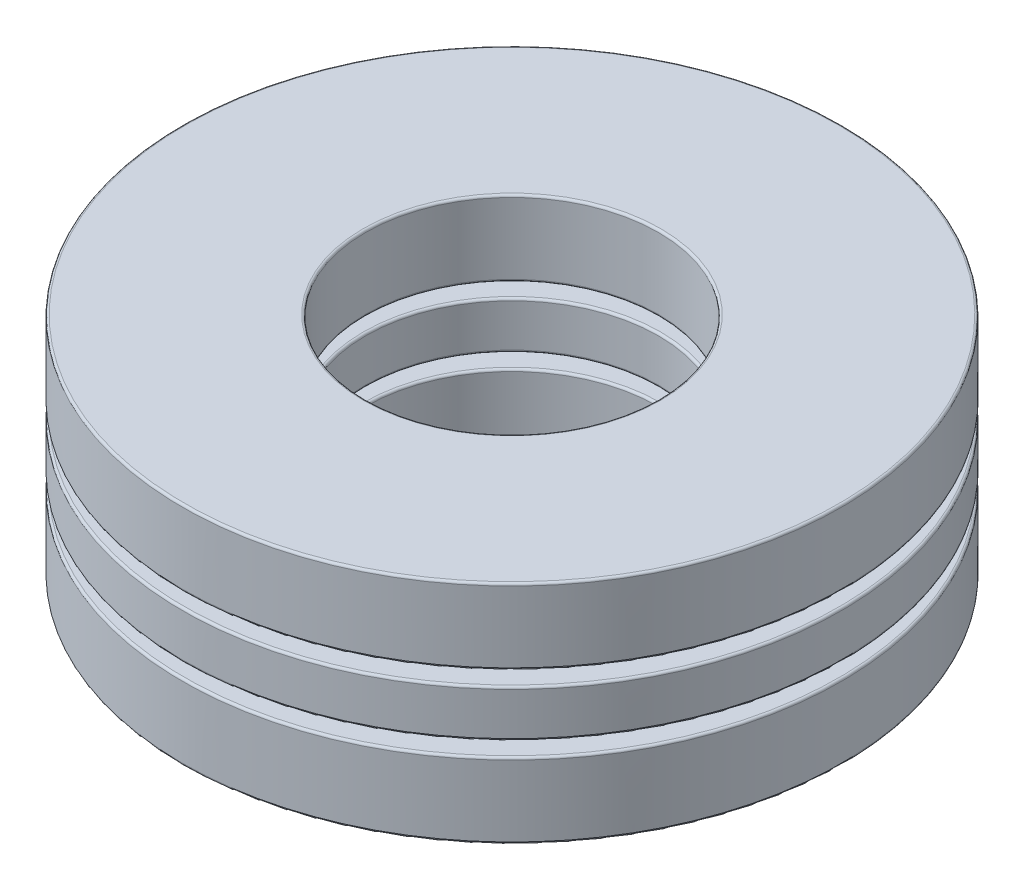
ISO-10303-21;
HEADER;
FILE_DESCRIPTION(('STEP AP214'),'2;1');
FILE_NAME('part.step','',(''),(''),'','','');
FILE_SCHEMA(('AUTOMOTIVE_DESIGN { 1 0 10303 214 1 1 1 1 }'));
ENDSEC;
DATA;
#1=APPLICATION_CONTEXT('core data for automotive mechanical design processes');
#2=APPLICATION_PROTOCOL_DEFINITION('international standard','automotive_design',2000,#1);
#3=PRODUCT_CONTEXT('',#1,'mechanical');
#4=PRODUCT('Part','Part','',(#3));
#5=PRODUCT_RELATED_PRODUCT_CATEGORY('part','',(#4));
#6=PRODUCT_DEFINITION_FORMATION('','',#4);
#7=PRODUCT_DEFINITION_CONTEXT('part definition',#1,'design');
#8=PRODUCT_DEFINITION('design','',#6,#7);
#9=PRODUCT_DEFINITION_SHAPE('','',#8);
#10=(LENGTH_UNIT() NAMED_UNIT(*) SI_UNIT(.MILLI.,.METRE.));
#11=(NAMED_UNIT(*) PLANE_ANGLE_UNIT() SI_UNIT($,.RADIAN.));
#12=(NAMED_UNIT(*) SI_UNIT($,.STERADIAN.) SOLID_ANGLE_UNIT());
#13=UNCERTAINTY_MEASURE_WITH_UNIT(LENGTH_MEASURE(1.E-05),#10,'distance_accuracy_value','');
#14=(GEOMETRIC_REPRESENTATION_CONTEXT(3) GLOBAL_UNCERTAINTY_ASSIGNED_CONTEXT((#13)) GLOBAL_UNIT_ASSIGNED_CONTEXT((#10,
#11,#12)) REPRESENTATION_CONTEXT('',''));
#15=CARTESIAN_POINT('',(0.,0.,0.));
#16=DIRECTION('',(0.,0.,1.));
#17=DIRECTION('',(1.,0.,0.));
#18=AXIS2_PLACEMENT_3D('',#15,#16,#17);
#19=CARTESIAN_POINT('',(0.,-2.4511,0.));
#20=DIRECTION('',(0.,-1.,0.));
#21=DIRECTION('',(0.,0.,-1.));
#22=AXIS2_PLACEMENT_3D('',#19,#20,#21);
#23=CYLINDRICAL_SURFACE('',#22,7.14375);
#24=CARTESIAN_POINT('',(0.,-2.402078,0.));
#25=DIRECTION('',(0.,1.,0.));
#26=DIRECTION('',(0.,0.,1.));
#27=AXIS2_PLACEMENT_3D('',#24,#25,#26);
#28=CIRCLE('',#27,7.14375);
#29=CARTESIAN_POINT('',(0.,-2.402078,7.14375));
#30=VERTEX_POINT('',#29);
#31=EDGE_CURVE('E13',#30,#30,#28,.T.);
#32=ORIENTED_EDGE('',*,*,#31,.T.);
#33=EDGE_LOOP('',(#32));
#34=FACE_BOUND('',#33,.T.);
#35=CARTESIAN_POINT('',(0.,-0.866055333333331,0.));
#36=DIRECTION('',(0.,-1.,0.));
#37=DIRECTION('',(0.,0.,-1.));
#38=AXIS2_PLACEMENT_3D('',#35,#36,#37);
#39=CIRCLE('',#38,7.14375);
#40=CARTESIAN_POINT('',(0.,-0.866055333333331,-7.14375));
#41=VERTEX_POINT('',#40);
#42=EDGE_CURVE('E59',#41,#41,#39,.T.);
#43=ORIENTED_EDGE('',*,*,#42,.T.);
#44=EDGE_LOOP('',(#43));
#45=FACE_BOUND('',#44,.T.);
#46=ADVANCED_FACE('F53',(#34,#45),#23,.T.);
#47=CARTESIAN_POINT('',(0.,-0.817033333333331,7.14375));
#48=DIRECTION('',(0.,-1.,0.));
#49=DIRECTION('',(0.,0.,-1.));
#50=AXIS2_PLACEMENT_3D('',#47,#48,#49);
#51=PLANE('',#50);
#52=CARTESIAN_POINT('',(0.,-0.817033333333331,0.));
#53=DIRECTION('',(0.,-1.,0.));
#54=DIRECTION('',(0.,0.,-1.));
#55=AXIS2_PLACEMENT_3D('',#52,#53,#54);
#56=CIRCLE('',#55,3.224022);
#57=CARTESIAN_POINT('',(0.,-0.817033333333331,-3.224022));
#58=VERTEX_POINT('',#57);
#59=EDGE_CURVE('E63',#58,#58,#56,.T.);
#60=ORIENTED_EDGE('',*,*,#59,.T.);
#61=EDGE_LOOP('',(#60));
#62=FACE_BOUND('',#61,.T.);
#63=CARTESIAN_POINT('',(0.,-0.817033333333331,0.));
#64=DIRECTION('',(0.,-1.,0.));
#65=DIRECTION('',(0.,0.,-1.));
#66=AXIS2_PLACEMENT_3D('',#63,#64,#65);
#67=CIRCLE('',#66,7.094728);
#68=CARTESIAN_POINT('',(0.,-0.817033333333331,-7.094728));
#69=VERTEX_POINT('',#68);
#70=EDGE_CURVE('E67',#69,#69,#67,.F.);
#71=ORIENTED_EDGE('',*,*,#70,.T.);
#72=EDGE_LOOP('',(#71));
#73=FACE_BOUND('',#72,.T.);
#74=ADVANCED_FACE('F95',(#62,#73),#51,.F.);
#75=CARTESIAN_POINT('',(0.,-2.4511,0.));
#76=DIRECTION('',(0.,-1.,0.));
#77=DIRECTION('',(0.,0.,-1.));
#78=AXIS2_PLACEMENT_3D('',#75,#76,#77);
#79=CYLINDRICAL_SURFACE('',#78,3.175);
#80=CARTESIAN_POINT('',(0.,-2.402078,0.));
#81=DIRECTION('',(0.,1.,0.));
#82=DIRECTION('',(0.,0.,1.));
#83=AXIS2_PLACEMENT_3D('',#80,#81,#82);
#84=CIRCLE('',#83,3.175);
#85=CARTESIAN_POINT('',(0.,-2.402078,3.175));
#86=VERTEX_POINT('',#85);
#87=EDGE_CURVE('E78',#86,#86,#84,.F.);
#88=ORIENTED_EDGE('',*,*,#87,.T.);
#89=EDGE_LOOP('',(#88));
#90=FACE_BOUND('',#89,.T.);
#91=CARTESIAN_POINT('',(0.,-0.866055333333331,0.));
#92=DIRECTION('',(0.,-1.,0.));
#93=DIRECTION('',(0.,0.,-1.));
#94=AXIS2_PLACEMENT_3D('',#91,#92,#93);
#95=CIRCLE('',#94,3.175);
#96=CARTESIAN_POINT('',(0.,-0.866055333333331,-3.175));
#97=VERTEX_POINT('',#96);
#98=EDGE_CURVE('E81',#97,#97,#95,.F.);
#99=ORIENTED_EDGE('',*,*,#98,.T.);
#100=EDGE_LOOP('',(#99));
#101=FACE_BOUND('',#100,.T.);
#102=ADVANCED_FACE('F85',(#90,#101),#79,.F.);
#103=CARTESIAN_POINT('',(0.,-2.4511,7.14375));
#104=DIRECTION('',(0.,1.,0.));
#105=DIRECTION('',(0.,0.,1.));
#106=AXIS2_PLACEMENT_3D('',#103,#104,#105);
#107=PLANE('',#106);
#108=CARTESIAN_POINT('',(0.,-2.4511,0.));
#109=DIRECTION('',(0.,1.,0.));
#110=DIRECTION('',(0.,0.,1.));
#111=AXIS2_PLACEMENT_3D('',#108,#109,#110);
#112=CIRCLE('',#111,3.224022);
#113=CARTESIAN_POINT('',(0.,-2.4511,3.224022));
#114=VERTEX_POINT('',#113);
#115=EDGE_CURVE('E72',#114,#114,#112,.T.);
#116=ORIENTED_EDGE('',*,*,#115,.T.);
#117=EDGE_LOOP('',(#116));
#118=FACE_BOUND('',#117,.T.);
#119=CARTESIAN_POINT('',(0.,-2.4511,0.));
#120=DIRECTION('',(0.,1.,0.));
#121=DIRECTION('',(0.,0.,1.));
#122=AXIS2_PLACEMENT_3D('',#119,#120,#121);
#123=CIRCLE('',#122,7.094728);
#124=CARTESIAN_POINT('',(0.,-2.4511,7.094728));
#125=VERTEX_POINT('',#124);
#126=EDGE_CURVE('E75',#125,#125,#123,.F.);
#127=ORIENTED_EDGE('',*,*,#126,.T.);
#128=EDGE_LOOP('',(#127));
#129=FACE_BOUND('',#128,.T.);
#130=ADVANCED_FACE('F122',(#118,#129),#107,.F.);
#131=CARTESIAN_POINT('',(0.,-2.402078,0.));
#132=DIRECTION('',(0.,1.,0.));
#133=DIRECTION('',(0.,0.,1.));
#134=AXIS2_PLACEMENT_3D('',#131,#132,#133);
#135=TOROIDAL_SURFACE('',#134,3.224022,0.049022);
#136=ORIENTED_EDGE('',*,*,#115,.F.);
#137=EDGE_LOOP('',(#136));
#138=FACE_BOUND('',#137,.T.);
#139=ORIENTED_EDGE('',*,*,#87,.F.);
#140=EDGE_LOOP('',(#139));
#141=FACE_BOUND('',#140,.T.);
#142=ADVANCED_FACE('F91',(#138,#141),#135,.T.);
#143=CARTESIAN_POINT('',(0.,-0.866055333333331,0.));
#144=DIRECTION('',(0.,-1.,0.));
#145=DIRECTION('',(0.,0.,-1.));
#146=AXIS2_PLACEMENT_3D('',#143,#144,#145);
#147=TOROIDAL_SURFACE('',#146,3.224022,0.049022);
#148=ORIENTED_EDGE('',*,*,#98,.F.);
#149=EDGE_LOOP('',(#148));
#150=FACE_BOUND('',#149,.T.);
#151=ORIENTED_EDGE('',*,*,#59,.F.);
#152=EDGE_LOOP('',(#151));
#153=FACE_BOUND('',#152,.T.);
#154=ADVANCED_FACE('F87',(#150,#153),#147,.T.);
#155=CARTESIAN_POINT('',(0.,-2.402078,0.));
#156=DIRECTION('',(0.,1.,0.));
#157=DIRECTION('',(0.,0.,1.));
#158=AXIS2_PLACEMENT_3D('',#155,#156,#157);
#159=TOROIDAL_SURFACE('',#158,7.094728,0.049022);
#160=ORIENTED_EDGE('',*,*,#31,.F.);
#161=EDGE_LOOP('',(#160));
#162=FACE_BOUND('',#161,.T.);
#163=ORIENTED_EDGE('',*,*,#126,.F.);
#164=EDGE_LOOP('',(#163));
#165=FACE_BOUND('',#164,.T.);
#166=ADVANCED_FACE('F90',(#162,#165),#159,.T.);
#167=CARTESIAN_POINT('',(0.,-0.866055333333331,0.));
#168=DIRECTION('',(0.,-1.,0.));
#169=DIRECTION('',(0.,0.,-1.));
#170=AXIS2_PLACEMENT_3D('',#167,#168,#169);
#171=TOROIDAL_SURFACE('',#170,7.094728,0.049022);
#172=ORIENTED_EDGE('',*,*,#70,.F.);
#173=EDGE_LOOP('',(#172));
#174=FACE_BOUND('',#173,.T.);
#175=ORIENTED_EDGE('',*,*,#42,.F.);
#176=EDGE_LOOP('',(#175));
#177=FACE_BOUND('',#176,.T.);
#178=ADVANCED_FACE('F100',(#174,#177),#171,.T.);
#179=CLOSED_SHELL('',(#46,#74,#102,#130,#142,#154,#166,#178));
#180=MANIFOLD_SOLID_BREP('B2',#179);
#181=CARTESIAN_POINT('',(0.,-2.4511,0.));
#182=DIRECTION('',(0.,-1.,0.));
#183=DIRECTION('',(0.,0.,-1.));
#184=AXIS2_PLACEMENT_3D('',#181,#182,#183);
#185=CYLINDRICAL_SURFACE('',#184,7.14375);
#186=CARTESIAN_POINT('',(0.,0.866055333333332,0.));
#187=DIRECTION('',(0.,1.,0.));
#188=DIRECTION('',(0.,0.,1.));
#189=AXIS2_PLACEMENT_3D('',#186,#187,#188);
#190=CIRCLE('',#189,7.14375);
#191=CARTESIAN_POINT('',(0.,0.866055333333332,7.14375));
#192=VERTEX_POINT('',#191);
#193=EDGE_CURVE('E52',#192,#192,#190,.T.);
#194=ORIENTED_EDGE('',*,*,#193,.T.);
#195=EDGE_LOOP('',(#194));
#196=FACE_BOUND('',#195,.T.);
#197=CARTESIAN_POINT('',(0.,2.402078,0.));
#198=DIRECTION('',(0.,-1.,0.));
#199=DIRECTION('',(0.,0.,-1.));
#200=AXIS2_PLACEMENT_3D('',#197,#198,#199);
#201=CIRCLE('',#200,7.14375);
#202=CARTESIAN_POINT('',(0.,2.402078,-7.14375));
#203=VERTEX_POINT('',#202);
#204=EDGE_CURVE('E192',#203,#203,#201,.T.);
#205=ORIENTED_EDGE('',*,*,#204,.T.);
#206=EDGE_LOOP('',(#205));
#207=FACE_BOUND('',#206,.T.);
#208=ADVANCED_FACE('F186',(#196,#207),#185,.T.);
#209=CARTESIAN_POINT('',(0.,2.4511,7.14375));
#210=DIRECTION('',(0.,-1.,0.));
#211=DIRECTION('',(0.,0.,-1.));
#212=AXIS2_PLACEMENT_3D('',#209,#210,#211);
#213=PLANE('',#212);
#214=CARTESIAN_POINT('',(0.,2.4511,0.));
#215=DIRECTION('',(0.,-1.,0.));
#216=DIRECTION('',(0.,0.,-1.));
#217=AXIS2_PLACEMENT_3D('',#214,#215,#216);
#218=CIRCLE('',#217,3.224022);
#219=CARTESIAN_POINT('',(0.,2.4511,-3.224022));
#220=VERTEX_POINT('',#219);
#221=EDGE_CURVE('E196',#220,#220,#218,.T.);
#222=ORIENTED_EDGE('',*,*,#221,.T.);
#223=EDGE_LOOP('',(#222));
#224=FACE_BOUND('',#223,.T.);
#225=CARTESIAN_POINT('',(0.,2.4511,0.));
#226=DIRECTION('',(0.,-1.,0.));
#227=DIRECTION('',(0.,0.,-1.));
#228=AXIS2_PLACEMENT_3D('',#225,#226,#227);
#229=CIRCLE('',#228,7.094728);
#230=CARTESIAN_POINT('',(0.,2.4511,-7.094728));
#231=VERTEX_POINT('',#230);
#232=EDGE_CURVE('E200',#231,#231,#229,.F.);
#233=ORIENTED_EDGE('',*,*,#232,.T.);
#234=EDGE_LOOP('',(#233));
#235=FACE_BOUND('',#234,.T.);
#236=ADVANCED_FACE('F228',(#224,#235),#213,.F.);
#237=CARTESIAN_POINT('',(0.,-2.4511,0.));
#238=DIRECTION('',(0.,-1.,0.));
#239=DIRECTION('',(0.,0.,-1.));
#240=AXIS2_PLACEMENT_3D('',#237,#238,#239);
#241=CYLINDRICAL_SURFACE('',#240,3.175);
#242=CARTESIAN_POINT('',(0.,0.866055333333332,0.));
#243=DIRECTION('',(0.,1.,0.));
#244=DIRECTION('',(0.,0.,1.));
#245=AXIS2_PLACEMENT_3D('',#242,#243,#244);
#246=CIRCLE('',#245,3.175);
#247=CARTESIAN_POINT('',(0.,0.866055333333332,3.175));
#248=VERTEX_POINT('',#247);
#249=EDGE_CURVE('E211',#248,#248,#246,.F.);
#250=ORIENTED_EDGE('',*,*,#249,.T.);
#251=EDGE_LOOP('',(#250));
#252=FACE_BOUND('',#251,.T.);
#253=CARTESIAN_POINT('',(0.,2.402078,0.));
#254=DIRECTION('',(0.,-1.,0.));
#255=DIRECTION('',(0.,0.,-1.));
#256=AXIS2_PLACEMENT_3D('',#253,#254,#255);
#257=CIRCLE('',#256,3.175);
#258=CARTESIAN_POINT('',(0.,2.402078,-3.175));
#259=VERTEX_POINT('',#258);
#260=EDGE_CURVE('E214',#259,#259,#257,.F.);
#261=ORIENTED_EDGE('',*,*,#260,.T.);
#262=EDGE_LOOP('',(#261));
#263=FACE_BOUND('',#262,.T.);
#264=ADVANCED_FACE('F218',(#252,#263),#241,.F.);
#265=CARTESIAN_POINT('',(0.,0.817033333333333,7.14375));
#266=DIRECTION('',(0.,1.,0.));
#267=DIRECTION('',(0.,0.,1.));
#268=AXIS2_PLACEMENT_3D('',#265,#266,#267);
#269=PLANE('',#268);
#270=CARTESIAN_POINT('',(0.,0.817033333333333,0.));
#271=DIRECTION('',(0.,1.,0.));
#272=DIRECTION('',(0.,0.,1.));
#273=AXIS2_PLACEMENT_3D('',#270,#271,#272);
#274=CIRCLE('',#273,3.224022);
#275=CARTESIAN_POINT('',(0.,0.817033333333333,3.224022));
#276=VERTEX_POINT('',#275);
#277=EDGE_CURVE('E205',#276,#276,#274,.T.);
#278=ORIENTED_EDGE('',*,*,#277,.T.);
#279=EDGE_LOOP('',(#278));
#280=FACE_BOUND('',#279,.T.);
#281=CARTESIAN_POINT('',(0.,0.817033333333333,0.));
#282=DIRECTION('',(0.,1.,0.));
#283=DIRECTION('',(0.,0.,1.));
#284=AXIS2_PLACEMENT_3D('',#281,#282,#283);
#285=CIRCLE('',#284,7.094728);
#286=CARTESIAN_POINT('',(0.,0.817033333333333,7.094728));
#287=VERTEX_POINT('',#286);
#288=EDGE_CURVE('E208',#287,#287,#285,.F.);
#289=ORIENTED_EDGE('',*,*,#288,.T.);
#290=EDGE_LOOP('',(#289));
#291=FACE_BOUND('',#290,.T.);
#292=ADVANCED_FACE('F255',(#280,#291),#269,.F.);
#293=CARTESIAN_POINT('',(0.,0.866055333333332,0.));
#294=DIRECTION('',(0.,1.,0.));
#295=DIRECTION('',(0.,0.,1.));
#296=AXIS2_PLACEMENT_3D('',#293,#294,#295);
#297=TOROIDAL_SURFACE('',#296,3.224022,0.049022);
#298=ORIENTED_EDGE('',*,*,#277,.F.);
#299=EDGE_LOOP('',(#298));
#300=FACE_BOUND('',#299,.T.);
#301=ORIENTED_EDGE('',*,*,#249,.F.);
#302=EDGE_LOOP('',(#301));
#303=FACE_BOUND('',#302,.T.);
#304=ADVANCED_FACE('F224',(#300,#303),#297,.T.);
#305=CARTESIAN_POINT('',(0.,2.402078,0.));
#306=DIRECTION('',(0.,-1.,0.));
#307=DIRECTION('',(0.,0.,-1.));
#308=AXIS2_PLACEMENT_3D('',#305,#306,#307);
#309=TOROIDAL_SURFACE('',#308,3.224022,0.049022);
#310=ORIENTED_EDGE('',*,*,#260,.F.);
#311=EDGE_LOOP('',(#310));
#312=FACE_BOUND('',#311,.T.);
#313=ORIENTED_EDGE('',*,*,#221,.F.);
#314=EDGE_LOOP('',(#313));
#315=FACE_BOUND('',#314,.T.);
#316=ADVANCED_FACE('F220',(#312,#315),#309,.T.);
#317=CARTESIAN_POINT('',(0.,0.866055333333332,0.));
#318=DIRECTION('',(0.,1.,0.));
#319=DIRECTION('',(0.,0.,1.));
#320=AXIS2_PLACEMENT_3D('',#317,#318,#319);
#321=TOROIDAL_SURFACE('',#320,7.094728,0.049022);
#322=ORIENTED_EDGE('',*,*,#193,.F.);
#323=EDGE_LOOP('',(#322));
#324=FACE_BOUND('',#323,.T.);
#325=ORIENTED_EDGE('',*,*,#288,.F.);
#326=EDGE_LOOP('',(#325));
#327=FACE_BOUND('',#326,.T.);
#328=ADVANCED_FACE('F223',(#324,#327),#321,.T.);
#329=CARTESIAN_POINT('',(0.,2.402078,0.));
#330=DIRECTION('',(0.,-1.,0.));
#331=DIRECTION('',(0.,0.,-1.));
#332=AXIS2_PLACEMENT_3D('',#329,#330,#331);
#333=TOROIDAL_SURFACE('',#332,7.094728,0.049022);
#334=ORIENTED_EDGE('',*,*,#232,.F.);
#335=EDGE_LOOP('',(#334));
#336=FACE_BOUND('',#335,.T.);
#337=ORIENTED_EDGE('',*,*,#204,.F.);
#338=EDGE_LOOP('',(#337));
#339=FACE_BOUND('',#338,.T.);
#340=ADVANCED_FACE('F233',(#336,#339),#333,.T.);
#341=CLOSED_SHELL('',(#208,#236,#264,#292,#304,#316,#328,#340));
#342=MANIFOLD_SOLID_BREP('B8',#341);
#343=CARTESIAN_POINT('',(-4.03376180485845,0.,3.21681769646495));
#344=DIRECTION('',(0.,1.,0.));
#345=DIRECTION('',(0.781831482468022,0.,-0.623489801858743));
#346=AXIS2_PLACEMENT_3D('',#343,#344,#345);
#347=SPHERICAL_SURFACE('',#346,0.817033333333333);
#348=CARTESIAN_POINT('',(-4.03376180485845,0.817033333333333,3.21681769646495));
#349=VERTEX_POINT('',#348);
#350=VERTEX_LOOP('',#349);
#351=FACE_BOUND('',#350,.T.);
#352=ADVANCED_FACE('F314',(#351),#347,.T.);
#353=CLOSED_SHELL('',(#352));
#354=MANIFOLD_SOLID_BREP('B47',#353);
#355=CARTESIAN_POINT('',(-5.03001869691311,0.,-1.14806894363081));
#356=DIRECTION('',(0.,1.,0.));
#357=DIRECTION('',(0.974927912181826,0.,0.222520933956305));
#358=AXIS2_PLACEMENT_3D('',#355,#356,#357);
#359=SPHERICAL_SURFACE('',#358,0.817033333333333);
#360=CARTESIAN_POINT('',(-5.03001869691311,0.817033333333333,-1.14806894363081));
#361=VERTEX_POINT('',#360);
#362=VERTEX_LOOP('',#361);
#363=FACE_BOUND('',#362,.T.);
#364=ADVANCED_FACE('F335',(#363),#359,.T.);
#365=CLOSED_SHELL('',(#364));
#366=MANIFOLD_SOLID_BREP('B182',#365);
#367=CARTESIAN_POINT('',(-2.23856891650969,0.,-4.64843625283403));
#368=DIRECTION('',(0.,1.,0.));
#369=DIRECTION('',(0.433883739117565,0.,0.900968867902416));
#370=AXIS2_PLACEMENT_3D('',#367,#368,#369);
#371=SPHERICAL_SURFACE('',#370,0.817033333333333);
#372=CARTESIAN_POINT('',(-2.23856891650969,0.817033333333333,-4.64843625283403));
#373=VERTEX_POINT('',#372);
#374=VERTEX_LOOP('',#373);
#375=FACE_BOUND('',#374,.T.);
#376=ADVANCED_FACE('F354',(#375),#371,.T.);
#377=CLOSED_SHELL('',(#376));
#378=MANIFOLD_SOLID_BREP('B310',#377);
#379=CARTESIAN_POINT('',(2.23856891650962,0.,-4.64843625283406));
#380=DIRECTION('',(0.,1.,0.));
#381=DIRECTION('',(-0.433883739117553,0.,0.900968867902422));
#382=AXIS2_PLACEMENT_3D('',#379,#380,#381);
#383=SPHERICAL_SURFACE('',#382,0.817033333333333);
#384=CARTESIAN_POINT('',(2.23856891650962,0.817033333333333,-4.64843625283406));
#385=VERTEX_POINT('',#384);
#386=VERTEX_LOOP('',#385);
#387=FACE_BOUND('',#386,.T.);
#388=ADVANCED_FACE('F376',(#387),#383,.T.);
#389=CLOSED_SHELL('',(#388));
#390=MANIFOLD_SOLID_BREP('B331',#389);
#391=CARTESIAN_POINT('',(5.03001869691309,0.,-1.14806894363088));
#392=DIRECTION('',(0.,1.,0.));
#393=DIRECTION('',(-0.974927912181823,0.,0.222520933956318));
#394=AXIS2_PLACEMENT_3D('',#391,#392,#393);
#395=SPHERICAL_SURFACE('',#394,0.817033333333333);
#396=CARTESIAN_POINT('',(5.03001869691309,0.817033333333333,-1.14806894363088));
#397=VERTEX_POINT('',#396);
#398=VERTEX_LOOP('',#397);
#399=FACE_BOUND('',#398,.T.);
#400=ADVANCED_FACE('F397',(#399),#395,.T.);
#401=CLOSED_SHELL('',(#400));
#402=MANIFOLD_SOLID_BREP('B350',#401);
#403=CARTESIAN_POINT('',(4.0337618048585,0.,3.2168176964649));
#404=DIRECTION('',(0.,1.,0.));
#405=DIRECTION('',(-0.781831482468031,0.,-0.623489801858732));
#406=AXIS2_PLACEMENT_3D('',#403,#404,#405);
#407=SPHERICAL_SURFACE('',#406,0.817033333333333);
#408=CARTESIAN_POINT('',(4.0337618048585,0.817033333333333,3.2168176964649));
#409=VERTEX_POINT('',#408);
#410=VERTEX_LOOP('',#409);
#411=FACE_BOUND('',#410,.T.);
#412=ADVANCED_FACE('F415',(#411),#407,.T.);
#413=CLOSED_SHELL('',(#412));
#414=MANIFOLD_SOLID_BREP('B372',#413);
#415=CARTESIAN_POINT('',(0.,0.,5.159375));
#416=DIRECTION('',(0.,1.,0.));
#417=DIRECTION('',(0.,0.,-1.));
#418=AXIS2_PLACEMENT_3D('',#415,#416,#417);
#419=SPHERICAL_SURFACE('',#418,0.817033333333333);
#420=CARTESIAN_POINT('',(0.,0.817033333333333,5.159375));
#421=VERTEX_POINT('',#420);
#422=VERTEX_LOOP('',#421);
#423=FACE_BOUND('',#422,.T.);
#424=ADVANCED_FACE('F435',(#423),#419,.T.);
#425=CLOSED_SHELL('',(#424));
#426=MANIFOLD_SOLID_BREP('B393',#425);
#427=CARTESIAN_POINT('',(0.,-2.4511,0.));
#428=DIRECTION('',(0.,-1.,0.));
#429=DIRECTION('',(0.,0.,-1.));
#430=AXIS2_PLACEMENT_3D('',#427,#428,#429);
#431=CYLINDRICAL_SURFACE('',#430,7.14375);
#432=CARTESIAN_POINT('',(0.,-0.461623833333338,0.));
#433=DIRECTION('',(0.,1.,0.));
#434=DIRECTION('',(0.,0.,1.));
#435=AXIS2_PLACEMENT_3D('',#432,#433,#434);
#436=CIRCLE('',#435,7.14375);
#437=CARTESIAN_POINT('',(0.,-0.461623833333338,7.14375));
#438=VERTEX_POINT('',#437);
#439=EDGE_CURVE('E434',#438,#438,#436,.T.);
#440=ORIENTED_EDGE('',*,*,#439,.T.);
#441=EDGE_LOOP('',(#440));
#442=FACE_BOUND('',#441,.T.);
#443=CARTESIAN_POINT('',(0.,0.461623833333328,0.));
#444=DIRECTION('',(0.,-1.,0.));
#445=DIRECTION('',(0.,0.,-1.));
#446=AXIS2_PLACEMENT_3D('',#443,#444,#445);
#447=CIRCLE('',#446,7.14375);
#448=CARTESIAN_POINT('',(0.,0.461623833333328,-7.14375));
#449=VERTEX_POINT('',#448);
#450=EDGE_CURVE('E457',#449,#449,#447,.T.);
#451=ORIENTED_EDGE('',*,*,#450,.T.);
#452=EDGE_LOOP('',(#451));
#453=FACE_BOUND('',#452,.T.);
#454=ADVANCED_FACE('F451',(#442,#453),#431,.T.);
#455=CARTESIAN_POINT('',(0.,-0.510645833333338,7.14375));
#456=DIRECTION('',(0.,1.,0.));
#457=DIRECTION('',(0.,0.,1.));
#458=AXIS2_PLACEMENT_3D('',#455,#456,#457);
#459=PLANE('',#458);
#460=CARTESIAN_POINT('',(0.,-0.510645833333338,0.));
#461=DIRECTION('',(0.,1.,0.));
#462=DIRECTION('',(0.,0.,1.));
#463=AXIS2_PLACEMENT_3D('',#460,#461,#462);
#464=CIRCLE('',#463,3.224022);
#465=CARTESIAN_POINT('',(0.,-0.510645833333338,3.224022));
#466=VERTEX_POINT('',#465);
#467=EDGE_CURVE('E470',#466,#466,#464,.T.);
#468=ORIENTED_EDGE('',*,*,#467,.T.);
#469=EDGE_LOOP('',(#468));
#470=FACE_BOUND('',#469,.T.);
#471=CARTESIAN_POINT('',(0.,-0.510645833333338,0.));
#472=DIRECTION('',(0.,1.,0.));
#473=DIRECTION('',(0.,0.,1.));
#474=AXIS2_PLACEMENT_3D('',#471,#472,#473);
#475=CIRCLE('',#474,7.094728);
#476=CARTESIAN_POINT('',(0.,-0.510645833333338,7.094728));
#477=VERTEX_POINT('',#476);
#478=EDGE_CURVE('E473',#477,#477,#475,.F.);
#479=ORIENTED_EDGE('',*,*,#478,.T.);
#480=EDGE_LOOP('',(#479));
#481=FACE_BOUND('',#480,.T.);
#482=CARTESIAN_POINT('',(-4.03376180485845,-0.510645833333338,3.21681769646495));
#483=DIRECTION('',(0.,1.,0.));
#484=DIRECTION('',(-0.781831482468022,0.,0.623489801858743));
#485=AXIS2_PLACEMENT_3D('',#482,#483,#484);
#486=CIRCLE('',#485,0.637796441411426);
#487=CARTESIAN_POINT('',(-4.53241114215998,-0.510645833333338,3.61447727334677));
#488=VERTEX_POINT('',#487);
#489=EDGE_CURVE('E518',#488,#488,#486,.T.);
#490=ORIENTED_EDGE('',*,*,#489,.T.);
#491=EDGE_LOOP('',(#490));
#492=FACE_BOUND('',#491,.T.);
#493=CARTESIAN_POINT('',(-5.03001869691311,-0.510645833333338,-1.14806894363081));
#494=DIRECTION('',(0.,1.,0.));
#495=DIRECTION('',(-0.974927912181826,0.,-0.222520933956305));
#496=AXIS2_PLACEMENT_3D('',#493,#494,#495);
#497=CIRCLE('',#496,0.637796441411426);
#498=CARTESIAN_POINT('',(-5.65182424993535,-0.510645833333338,-1.28999200344769));
#499=VERTEX_POINT('',#498);
#500=EDGE_CURVE('E512',#499,#499,#497,.T.);
#501=ORIENTED_EDGE('',*,*,#500,.T.);
#502=EDGE_LOOP('',(#501));
#503=FACE_BOUND('',#502,.T.);
#504=CARTESIAN_POINT('',(-2.23856891650969,-0.510645833333338,-4.64843625283403));
#505=DIRECTION('',(0.,1.,0.));
#506=DIRECTION('',(-0.433883739117565,0.,-0.900968867902416));
#507=AXIS2_PLACEMENT_3D('',#504,#505,#506);
#508=CIRCLE('',#507,0.637796441411426);
#509=CARTESIAN_POINT('',(-2.51529842130515,-0.510645833333338,-5.22307099060467));
#510=VERTEX_POINT('',#509);
#511=EDGE_CURVE('E506',#510,#510,#508,.T.);
#512=ORIENTED_EDGE('',*,*,#511,.T.);
#513=EDGE_LOOP('',(#512));
#514=FACE_BOUND('',#513,.T.);
#515=CARTESIAN_POINT('',(2.23856891650962,-0.510645833333338,-4.64843625283406));
#516=DIRECTION('',(0.,1.,0.));
#517=DIRECTION('',(0.433883739117553,0.,-0.900968867902422));
#518=AXIS2_PLACEMENT_3D('',#515,#516,#517);
#519=CIRCLE('',#518,0.637796441411426);
#520=CARTESIAN_POINT('',(2.51529842130508,-0.510645833333338,-5.2230709906047));
#521=VERTEX_POINT('',#520);
#522=EDGE_CURVE('E500',#521,#521,#519,.T.);
#523=ORIENTED_EDGE('',*,*,#522,.T.);
#524=EDGE_LOOP('',(#523));
#525=FACE_BOUND('',#524,.T.);
#526=CARTESIAN_POINT('',(5.03001869691309,-0.510645833333338,-1.14806894363088));
#527=DIRECTION('',(0.,1.,0.));
#528=DIRECTION('',(0.974927912181823,0.,-0.222520933956318));
#529=AXIS2_PLACEMENT_3D('',#526,#527,#528);
#530=CIRCLE('',#529,0.637796441411426);
#531=CARTESIAN_POINT('',(5.65182424993533,-0.510645833333338,-1.28999200344777));
#532=VERTEX_POINT('',#531);
#533=EDGE_CURVE('E494',#532,#532,#530,.T.);
#534=ORIENTED_EDGE('',*,*,#533,.T.);
#535=EDGE_LOOP('',(#534));
#536=FACE_BOUND('',#535,.T.);
#537=CARTESIAN_POINT('',(4.0337618048585,-0.510645833333338,3.2168176964649));
#538=DIRECTION('',(0.,1.,0.));
#539=DIRECTION('',(0.781831482468031,0.,0.623489801858732));
#540=AXIS2_PLACEMENT_3D('',#537,#538,#539);
#541=CIRCLE('',#540,0.637796441411426);
#542=CARTESIAN_POINT('',(4.53241114216003,-0.510645833333338,3.61447727334671));
#543=VERTEX_POINT('',#542);
#544=EDGE_CURVE('E486',#543,#543,#541,.T.);
#545=ORIENTED_EDGE('',*,*,#544,.T.);
#546=EDGE_LOOP('',(#545));
#547=FACE_BOUND('',#546,.T.);
#548=CARTESIAN_POINT('',(0.,-0.510645833333338,5.159375));
#549=DIRECTION('',(0.,1.,0.));
#550=DIRECTION('',(0.,0.,1.));
#551=AXIS2_PLACEMENT_3D('',#548,#549,#550);
#552=CIRCLE('',#551,0.637796441411426);
#553=CARTESIAN_POINT('',(0.,-0.510645833333338,5.79717144141143));
#554=VERTEX_POINT('',#553);
#555=EDGE_CURVE('E482',#554,#554,#552,.T.);
#556=ORIENTED_EDGE('',*,*,#555,.T.);
#557=EDGE_LOOP('',(#556));
#558=FACE_BOUND('',#557,.T.);
#559=ADVANCED_FACE('F536',(#470,#481,#492,#503,#514,#525,#536,#547,#558),#459,.F.);
#560=CARTESIAN_POINT('',(0.,-2.4511,0.));
#561=DIRECTION('',(0.,-1.,0.));
#562=DIRECTION('',(0.,0.,-1.));
#563=AXIS2_PLACEMENT_3D('',#560,#561,#562);
#564=CYLINDRICAL_SURFACE('',#563,3.175);
#565=CARTESIAN_POINT('',(0.,-0.461623833333338,0.));
#566=DIRECTION('',(0.,1.,0.));
#567=DIRECTION('',(0.,0.,1.));
#568=AXIS2_PLACEMENT_3D('',#565,#566,#567);
#569=CIRCLE('',#568,3.175);
#570=CARTESIAN_POINT('',(0.,-0.461623833333338,3.175));
#571=VERTEX_POINT('',#570);
#572=EDGE_CURVE('E476',#571,#571,#569,.F.);
#573=ORIENTED_EDGE('',*,*,#572,.T.);
#574=EDGE_LOOP('',(#573));
#575=FACE_BOUND('',#574,.T.);
#576=CARTESIAN_POINT('',(0.,0.461623833333328,0.));
#577=DIRECTION('',(0.,-1.,0.));
#578=DIRECTION('',(0.,0.,-1.));
#579=AXIS2_PLACEMENT_3D('',#576,#577,#578);
#580=CIRCLE('',#579,3.175);
#581=CARTESIAN_POINT('',(0.,0.461623833333328,-3.175));
#582=VERTEX_POINT('',#581);
#583=EDGE_CURVE('E479',#582,#582,#580,.F.);
#584=ORIENTED_EDGE('',*,*,#583,.T.);
#585=EDGE_LOOP('',(#584));
#586=FACE_BOUND('',#585,.T.);
#587=ADVANCED_FACE('F539',(#575,#586),#564,.F.);
#588=CARTESIAN_POINT('',(0.,0.510645833333328,7.14375));
#589=DIRECTION('',(0.,-1.,0.));
#590=DIRECTION('',(0.,0.,-1.));
#591=AXIS2_PLACEMENT_3D('',#588,#589,#590);
#592=PLANE('',#591);
#593=CARTESIAN_POINT('',(0.,0.510645833333328,0.));
#594=DIRECTION('',(0.,-1.,0.));
#595=DIRECTION('',(0.,0.,-1.));
#596=AXIS2_PLACEMENT_3D('',#593,#594,#595);
#597=CIRCLE('',#596,3.224022);
#598=CARTESIAN_POINT('',(0.,0.510645833333328,-3.224022));
#599=VERTEX_POINT('',#598);
#600=EDGE_CURVE('E461',#599,#599,#597,.T.);
#601=ORIENTED_EDGE('',*,*,#600,.T.);
#602=EDGE_LOOP('',(#601));
#603=FACE_BOUND('',#602,.T.);
#604=CARTESIAN_POINT('',(0.,0.510645833333328,0.));
#605=DIRECTION('',(0.,-1.,0.));
#606=DIRECTION('',(0.,0.,-1.));
#607=AXIS2_PLACEMENT_3D('',#604,#605,#606);
#608=CIRCLE('',#607,7.094728);
#609=CARTESIAN_POINT('',(0.,0.510645833333328,-7.094728));
#610=VERTEX_POINT('',#609);
#611=EDGE_CURVE('E465',#610,#610,#608,.F.);
#612=ORIENTED_EDGE('',*,*,#611,.T.);
#613=EDGE_LOOP('',(#612));
#614=FACE_BOUND('',#613,.T.);
#615=CARTESIAN_POINT('',(-4.03376180485845,0.510645833333328,3.21681769646495));
#616=DIRECTION('',(0.,-1.,0.));
#617=DIRECTION('',(0.781831482468022,0.,-0.623489801858743));
#618=AXIS2_PLACEMENT_3D('',#615,#616,#617);
#619=CIRCLE('',#618,0.637796441411434);
#620=CARTESIAN_POINT('',(-3.53511246755692,0.510645833333328,2.81915811958313));
#621=VERTEX_POINT('',#620);
#622=EDGE_CURVE('E521',#621,#621,#619,.T.);
#623=ORIENTED_EDGE('',*,*,#622,.T.);
#624=EDGE_LOOP('',(#623));
#625=FACE_BOUND('',#624,.T.);
#626=CARTESIAN_POINT('',(-5.03001869691311,0.510645833333328,-1.14806894363081));
#627=DIRECTION('',(0.,-1.,0.));
#628=DIRECTION('',(0.974927912181826,0.,0.222520933956305));
#629=AXIS2_PLACEMENT_3D('',#626,#627,#628);
#630=CIRCLE('',#629,0.637796441411434);
#631=CARTESIAN_POINT('',(-4.40821314389086,0.510645833333328,-1.00614588381393));
#632=VERTEX_POINT('',#631);
#633=EDGE_CURVE('E515',#632,#632,#630,.T.);
#634=ORIENTED_EDGE('',*,*,#633,.T.);
#635=EDGE_LOOP('',(#634));
#636=FACE_BOUND('',#635,.T.);
#637=CARTESIAN_POINT('',(-2.23856891650969,0.510645833333328,-4.64843625283403));
#638=DIRECTION('',(0.,-1.,0.));
#639=DIRECTION('',(0.433883739117565,0.,0.900968867902416));
#640=AXIS2_PLACEMENT_3D('',#637,#638,#639);
#641=CIRCLE('',#640,0.637796441411434);
#642=CARTESIAN_POINT('',(-1.96183941171422,0.510645833333328,-4.07380151506338));
#643=VERTEX_POINT('',#642);
#644=EDGE_CURVE('E509',#643,#643,#641,.T.);
#645=ORIENTED_EDGE('',*,*,#644,.T.);
#646=EDGE_LOOP('',(#645));
#647=FACE_BOUND('',#646,.T.);
#648=CARTESIAN_POINT('',(2.23856891650962,0.510645833333328,-4.64843625283406));
#649=DIRECTION('',(0.,-1.,0.));
#650=DIRECTION('',(-0.433883739117553,0.,0.900968867902422));
#651=AXIS2_PLACEMENT_3D('',#648,#649,#650);
#652=CIRCLE('',#651,0.637796441411434);
#653=CARTESIAN_POINT('',(1.96183941171416,0.510645833333328,-4.07380151506341));
#654=VERTEX_POINT('',#653);
#655=EDGE_CURVE('E503',#654,#654,#652,.T.);
#656=ORIENTED_EDGE('',*,*,#655,.T.);
#657=EDGE_LOOP('',(#656));
#658=FACE_BOUND('',#657,.T.);
#659=CARTESIAN_POINT('',(5.03001869691309,0.510645833333328,-1.14806894363088));
#660=DIRECTION('',(0.,-1.,0.));
#661=DIRECTION('',(-0.974927912181823,0.,0.222520933956318));
#662=AXIS2_PLACEMENT_3D('',#659,#660,#661);
#663=CIRCLE('',#662,0.637796441411434);
#664=CARTESIAN_POINT('',(4.40821314389085,0.510645833333328,-1.00614588381399));
#665=VERTEX_POINT('',#664);
#666=EDGE_CURVE('E497',#665,#665,#663,.T.);
#667=ORIENTED_EDGE('',*,*,#666,.T.);
#668=EDGE_LOOP('',(#667));
#669=FACE_BOUND('',#668,.T.);
#670=CARTESIAN_POINT('',(4.0337618048585,0.510645833333328,3.2168176964649));
#671=DIRECTION('',(0.,-1.,0.));
#672=DIRECTION('',(-0.781831482468031,0.,-0.623489801858732));
#673=AXIS2_PLACEMENT_3D('',#670,#671,#672);
#674=CIRCLE('',#673,0.637796441411434);
#675=CARTESIAN_POINT('',(3.53511246755696,0.510645833333328,2.81915811958308));
#676=VERTEX_POINT('',#675);
#677=EDGE_CURVE('E491',#676,#676,#674,.T.);
#678=ORIENTED_EDGE('',*,*,#677,.T.);
#679=EDGE_LOOP('',(#678));
#680=FACE_BOUND('',#679,.T.);
#681=CARTESIAN_POINT('',(0.,0.510645833333328,5.159375));
#682=DIRECTION('',(0.,-1.,0.));
#683=DIRECTION('',(0.,0.,-1.));
#684=AXIS2_PLACEMENT_3D('',#681,#682,#683);
#685=CIRCLE('',#684,0.637796441411434);
#686=CARTESIAN_POINT('',(0.,0.510645833333328,4.52157855858857));
#687=VERTEX_POINT('',#686);
#688=EDGE_CURVE('E483',#687,#687,#685,.T.);
#689=ORIENTED_EDGE('',*,*,#688,.T.);
#690=EDGE_LOOP('',(#689));
#691=FACE_BOUND('',#690,.T.);
#692=ADVANCED_FACE('F525',(#603,#614,#625,#636,#647,#658,#669,#680,#691),#592,.F.);
#693=CARTESIAN_POINT('',(0.,0.,5.159375));
#694=DIRECTION('',(0.,1.,0.));
#695=DIRECTION('',(0.,0.,-1.));
#696=AXIS2_PLACEMENT_3D('',#693,#694,#695);
#697=SPHERICAL_SURFACE('',#696,0.817033333333333);
#698=ORIENTED_EDGE('',*,*,#688,.F.);
#699=EDGE_LOOP('',(#698));
#700=FACE_BOUND('',#699,.T.);
#701=ORIENTED_EDGE('',*,*,#555,.F.);
#702=EDGE_LOOP('',(#701));
#703=FACE_BOUND('',#702,.T.);
#704=ADVANCED_FACE('F553',(#700,#703),#697,.F.);
#705=CARTESIAN_POINT('',(4.0337618048585,0.,3.2168176964649));
#706=DIRECTION('',(0.,1.,0.));
#707=DIRECTION('',(-0.781831482468031,0.,-0.623489801858732));
#708=AXIS2_PLACEMENT_3D('',#705,#706,#707);
#709=SPHERICAL_SURFACE('',#708,0.817033333333333);
#710=ORIENTED_EDGE('',*,*,#677,.F.);
#711=EDGE_LOOP('',(#710));
#712=FACE_BOUND('',#711,.T.);
#713=ORIENTED_EDGE('',*,*,#544,.F.);
#714=EDGE_LOOP('',(#713));
#715=FACE_BOUND('',#714,.T.);
#716=ADVANCED_FACE('F555',(#712,#715),#709,.F.);
#717=CARTESIAN_POINT('',(5.03001869691309,0.,-1.14806894363088));
#718=DIRECTION('',(0.,1.,0.));
#719=DIRECTION('',(-0.974927912181823,0.,0.222520933956318));
#720=AXIS2_PLACEMENT_3D('',#717,#718,#719);
#721=SPHERICAL_SURFACE('',#720,0.817033333333333);
#722=ORIENTED_EDGE('',*,*,#666,.F.);
#723=EDGE_LOOP('',(#722));
#724=FACE_BOUND('',#723,.T.);
#725=ORIENTED_EDGE('',*,*,#533,.F.);
#726=EDGE_LOOP('',(#725));
#727=FACE_BOUND('',#726,.T.);
#728=ADVANCED_FACE('F562',(#724,#727),#721,.F.);
#729=CARTESIAN_POINT('',(2.23856891650962,0.,-4.64843625283406));
#730=DIRECTION('',(0.,1.,0.));
#731=DIRECTION('',(-0.433883739117553,0.,0.900968867902422));
#732=AXIS2_PLACEMENT_3D('',#729,#730,#731);
#733=SPHERICAL_SURFACE('',#732,0.817033333333333);
#734=ORIENTED_EDGE('',*,*,#655,.F.);
#735=EDGE_LOOP('',(#734));
#736=FACE_BOUND('',#735,.T.);
#737=ORIENTED_EDGE('',*,*,#522,.F.);
#738=EDGE_LOOP('',(#737));
#739=FACE_BOUND('',#738,.T.);
#740=ADVANCED_FACE('F641',(#736,#739),#733,.F.);
#741=CARTESIAN_POINT('',(-2.23856891650969,0.,-4.64843625283403));
#742=DIRECTION('',(0.,1.,0.));
#743=DIRECTION('',(0.433883739117565,0.,0.900968867902416));
#744=AXIS2_PLACEMENT_3D('',#741,#742,#743);
#745=SPHERICAL_SURFACE('',#744,0.817033333333333);
#746=ORIENTED_EDGE('',*,*,#644,.F.);
#747=EDGE_LOOP('',(#746));
#748=FACE_BOUND('',#747,.T.);
#749=ORIENTED_EDGE('',*,*,#511,.F.);
#750=EDGE_LOOP('',(#749));
#751=FACE_BOUND('',#750,.T.);
#752=ADVANCED_FACE('F637',(#748,#751),#745,.F.);
#753=CARTESIAN_POINT('',(-5.03001869691311,0.,-1.14806894363081));
#754=DIRECTION('',(0.,1.,0.));
#755=DIRECTION('',(0.974927912181826,0.,0.222520933956305));
#756=AXIS2_PLACEMENT_3D('',#753,#754,#755);
#757=SPHERICAL_SURFACE('',#756,0.817033333333333);
#758=ORIENTED_EDGE('',*,*,#633,.F.);
#759=EDGE_LOOP('',(#758));
#760=FACE_BOUND('',#759,.T.);
#761=ORIENTED_EDGE('',*,*,#500,.F.);
#762=EDGE_LOOP('',(#761));
#763=FACE_BOUND('',#762,.T.);
#764=ADVANCED_FACE('F532',(#760,#763),#757,.F.);
#765=CARTESIAN_POINT('',(-4.03376180485845,0.,3.21681769646495));
#766=DIRECTION('',(0.,1.,0.));
#767=DIRECTION('',(0.781831482468022,0.,-0.623489801858743));
#768=AXIS2_PLACEMENT_3D('',#765,#766,#767);
#769=SPHERICAL_SURFACE('',#768,0.817033333333333);
#770=ORIENTED_EDGE('',*,*,#622,.F.);
#771=EDGE_LOOP('',(#770));
#772=FACE_BOUND('',#771,.T.);
#773=ORIENTED_EDGE('',*,*,#489,.F.);
#774=EDGE_LOOP('',(#773));
#775=FACE_BOUND('',#774,.T.);
#776=ADVANCED_FACE('F528',(#772,#775),#769,.F.);
#777=CARTESIAN_POINT('',(0.,-0.461623833333338,0.));
#778=DIRECTION('',(0.,1.,0.));
#779=DIRECTION('',(0.,0.,1.));
#780=AXIS2_PLACEMENT_3D('',#777,#778,#779);
#781=TOROIDAL_SURFACE('',#780,3.224022,0.049022);
#782=ORIENTED_EDGE('',*,*,#467,.F.);
#783=EDGE_LOOP('',(#782));
#784=FACE_BOUND('',#783,.T.);
#785=ORIENTED_EDGE('',*,*,#572,.F.);
#786=EDGE_LOOP('',(#785));
#787=FACE_BOUND('',#786,.T.);
#788=ADVANCED_FACE('F531',(#784,#787),#781,.T.);
#789=CARTESIAN_POINT('',(0.,0.461623833333328,0.));
#790=DIRECTION('',(0.,-1.,0.));
#791=DIRECTION('',(0.,0.,-1.));
#792=AXIS2_PLACEMENT_3D('',#789,#790,#791);
#793=TOROIDAL_SURFACE('',#792,3.224022,0.049022);
#794=ORIENTED_EDGE('',*,*,#583,.F.);
#795=EDGE_LOOP('',(#794));
#796=FACE_BOUND('',#795,.T.);
#797=ORIENTED_EDGE('',*,*,#600,.F.);
#798=EDGE_LOOP('',(#797));
#799=FACE_BOUND('',#798,.T.);
#800=ADVANCED_FACE('F597',(#796,#799),#793,.T.);
#801=CARTESIAN_POINT('',(0.,-0.461623833333338,0.));
#802=DIRECTION('',(0.,1.,0.));
#803=DIRECTION('',(0.,0.,1.));
#804=AXIS2_PLACEMENT_3D('',#801,#802,#803);
#805=TOROIDAL_SURFACE('',#804,7.094728,0.049022);
#806=ORIENTED_EDGE('',*,*,#439,.F.);
#807=EDGE_LOOP('',(#806));
#808=FACE_BOUND('',#807,.T.);
#809=ORIENTED_EDGE('',*,*,#478,.F.);
#810=EDGE_LOOP('',(#809));
#811=FACE_BOUND('',#810,.T.);
#812=ADVANCED_FACE('F608',(#808,#811),#805,.T.);
#813=CARTESIAN_POINT('',(0.,0.461623833333328,0.));
#814=DIRECTION('',(0.,-1.,0.));
#815=DIRECTION('',(0.,0.,-1.));
#816=AXIS2_PLACEMENT_3D('',#813,#814,#815);
#817=TOROIDAL_SURFACE('',#816,7.094728,0.049022);
#818=ORIENTED_EDGE('',*,*,#611,.F.);
#819=EDGE_LOOP('',(#818));
#820=FACE_BOUND('',#819,.T.);
#821=ORIENTED_EDGE('',*,*,#450,.F.);
#822=EDGE_LOOP('',(#821));
#823=FACE_BOUND('',#822,.T.);
#824=ADVANCED_FACE('F618',(#820,#823),#817,.T.);
#825=CLOSED_SHELL('',(#454,#559,#587,#692,#704,#716,#728,#740,#752,#764,#776,#788,#800,#812,#824));
#826=MANIFOLD_SOLID_BREP('B411',#825);
#827=ADVANCED_BREP_SHAPE_REPRESENTATION('',(#18,#180,#342,#354,#366,#378,#390,#402,#414,#426,
#826),#14);
#828=SHAPE_DEFINITION_REPRESENTATION(#9,#827);
ENDSEC;
END-ISO-10303-21;
